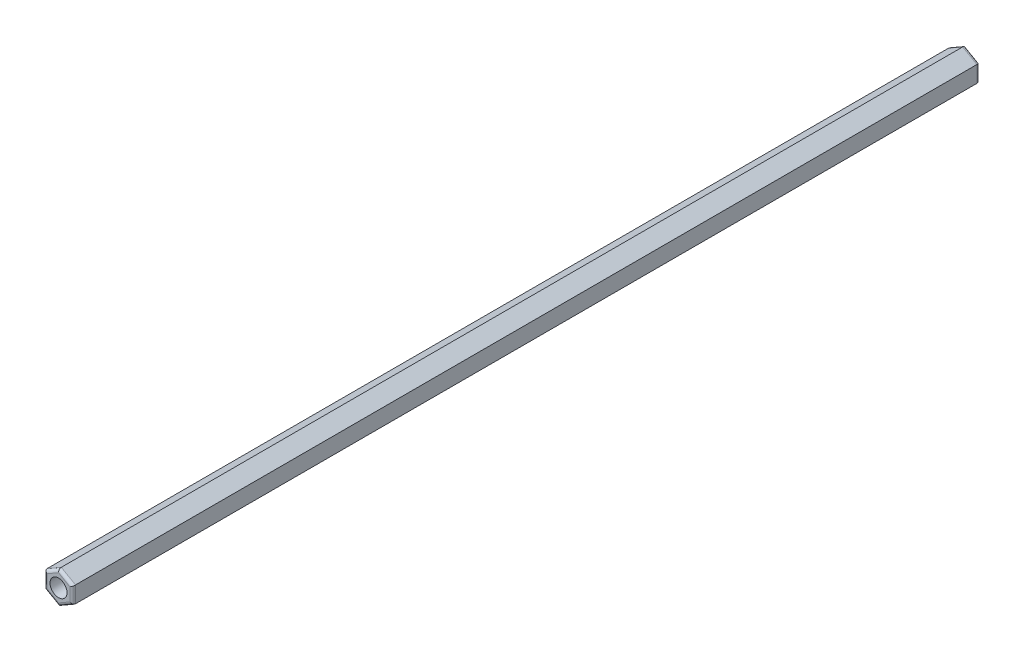
ISO-10303-21;
HEADER;
FILE_DESCRIPTION(('STEP AP214'),'2;1');
FILE_NAME('part.step','',(''),(''),'','','');
FILE_SCHEMA(('AUTOMOTIVE_DESIGN { 1 0 10303 214 1 1 1 1 }'));
ENDSEC;
DATA;
#1=APPLICATION_CONTEXT('core data for automotive mechanical design processes');
#2=APPLICATION_PROTOCOL_DEFINITION('international standard','automotive_design',2000,#1);
#3=PRODUCT_CONTEXT('',#1,'mechanical');
#4=PRODUCT('Part','Part','',(#3));
#5=PRODUCT_RELATED_PRODUCT_CATEGORY('part','',(#4));
#6=PRODUCT_DEFINITION_FORMATION('','',#4);
#7=PRODUCT_DEFINITION_CONTEXT('part definition',#1,'design');
#8=PRODUCT_DEFINITION('design','',#6,#7);
#9=PRODUCT_DEFINITION_SHAPE('','',#8);
#10=(LENGTH_UNIT() NAMED_UNIT(*) SI_UNIT(.MILLI.,.METRE.));
#11=(NAMED_UNIT(*) PLANE_ANGLE_UNIT() SI_UNIT($,.RADIAN.));
#12=(NAMED_UNIT(*) SI_UNIT($,.STERADIAN.) SOLID_ANGLE_UNIT());
#13=UNCERTAINTY_MEASURE_WITH_UNIT(LENGTH_MEASURE(1.E-05),#10,'distance_accuracy_value','');
#14=(GEOMETRIC_REPRESENTATION_CONTEXT(3) GLOBAL_UNCERTAINTY_ASSIGNED_CONTEXT((#13)) GLOBAL_UNIT_ASSIGNED_CONTEXT((#10,
#11,#12)) REPRESENTATION_CONTEXT('',''));
#15=CARTESIAN_POINT('',(0.,0.,0.));
#16=DIRECTION('',(0.,0.,1.));
#17=DIRECTION('',(1.,0.,0.));
#18=AXIS2_PLACEMENT_3D('',#15,#16,#17);
#19=CARTESIAN_POINT('',(-67.50212267549,1.44337567297406,160.));
#20=DIRECTION('',(1.,0.,0.));
#21=DIRECTION('',(0.,0.,-1.));
#22=AXIS2_PLACEMENT_3D('',#19,#20,#21);
#23=PLANE('',#22);
#24=DIRECTION('',(0.,0.,-1.));
#25=VECTOR('',#24,1.);
#26=CARTESIAN_POINT('',(-67.50212267549,-1.44337567297407,160.));
#27=LINE('',#26,#25);
#28=CARTESIAN_POINT('',(-67.50212267549,-1.44337567297407,159.5));
#29=VERTEX_POINT('',#28);
#30=CARTESIAN_POINT('',(-67.50212267549,-1.44337567297407,0.5));
#31=VERTEX_POINT('',#30);
#32=EDGE_CURVE('E152',#29,#31,#27,.T.);
#33=ORIENTED_EDGE('',*,*,#32,.T.);
#34=DIRECTION('',(0.,-1.,0.));
#35=VECTOR('',#34,1.);
#36=CARTESIAN_POINT('',(-67.50212267549,1.44337567297406,0.5));
#37=LINE('',#36,#35);
#38=CARTESIAN_POINT('',(-67.50212267549,1.44337567297406,0.5));
#39=VERTEX_POINT('',#38);
#40=EDGE_CURVE('E149',#31,#39,#37,.F.);
#41=ORIENTED_EDGE('',*,*,#40,.T.);
#42=DIRECTION('',(0.,0.,-1.));
#43=VECTOR('',#42,1.);
#44=CARTESIAN_POINT('',(-67.50212267549,1.44337567297406,160.));
#45=LINE('',#44,#43);
#46=CARTESIAN_POINT('',(-67.50212267549,1.44337567297406,159.5));
#47=VERTEX_POINT('',#46);
#48=EDGE_CURVE('E146',#47,#39,#45,.T.);
#49=ORIENTED_EDGE('',*,*,#48,.F.);
#50=DIRECTION('',(0.,-1.,0.));
#51=VECTOR('',#50,1.);
#52=CARTESIAN_POINT('',(-67.50212267549,-1.44337567297407,159.5));
#53=LINE('',#52,#51);
#54=EDGE_CURVE('E206',#47,#29,#53,.T.);
#55=ORIENTED_EDGE('',*,*,#54,.T.);
#56=EDGE_LOOP('',(#33,#41,#49,#55));
#57=FACE_BOUND('',#56,.T.);
#58=ADVANCED_FACE('F32',(#57),#23,.T.);
#59=CARTESIAN_POINT('',(-70.00212267549,2.88675134594811,160.));
#60=DIRECTION('',(0.5,0.866025403784439,0.));
#61=DIRECTION('',(-0.866025403784439,0.5,0.));
#62=AXIS2_PLACEMENT_3D('',#59,#60,#61);
#63=PLANE('',#62);
#64=ORIENTED_EDGE('',*,*,#48,.T.);
#65=DIRECTION('',(0.866025403784439,-0.5,0.));
#66=VECTOR('',#65,1.);
#67=CARTESIAN_POINT('',(-70.00212267549,2.88675134594811,0.5));
#68=LINE('',#67,#66);
#69=CARTESIAN_POINT('',(-70.00212267549,2.88675134594811,0.5));
#70=VERTEX_POINT('',#69);
#71=EDGE_CURVE('E191',#39,#70,#68,.F.);
#72=ORIENTED_EDGE('',*,*,#71,.T.);
#73=DIRECTION('',(0.,0.,-1.));
#74=VECTOR('',#73,1.);
#75=CARTESIAN_POINT('',(-70.00212267549,2.88675134594811,160.));
#76=LINE('',#75,#74);
#77=CARTESIAN_POINT('',(-70.00212267549,2.88675134594811,159.5));
#78=VERTEX_POINT('',#77);
#79=EDGE_CURVE('E255',#78,#70,#76,.T.);
#80=ORIENTED_EDGE('',*,*,#79,.F.);
#81=DIRECTION('',(0.866025403784439,-0.5,0.));
#82=VECTOR('',#81,1.);
#83=CARTESIAN_POINT('',(-67.50212267549,1.44337567297406,159.5));
#84=LINE('',#83,#82);
#85=EDGE_CURVE('E197',#78,#47,#84,.T.);
#86=ORIENTED_EDGE('',*,*,#85,.T.);
#87=EDGE_LOOP('',(#64,#72,#80,#86));
#88=FACE_BOUND('',#87,.T.);
#89=ADVANCED_FACE('F284',(#88),#63,.T.);
#90=CARTESIAN_POINT('',(-72.50212267549,1.44337567297405,160.));
#91=DIRECTION('',(-0.5,0.866025403784439,0.));
#92=DIRECTION('',(-0.866025403784439,-0.5,0.));
#93=AXIS2_PLACEMENT_3D('',#90,#91,#92);
#94=PLANE('',#93);
#95=ORIENTED_EDGE('',*,*,#79,.T.);
#96=DIRECTION('',(0.866025403784439,0.5,0.));
#97=VECTOR('',#96,1.);
#98=CARTESIAN_POINT('',(-72.50212267549,1.44337567297405,0.5));
#99=LINE('',#98,#97);
#100=CARTESIAN_POINT('',(-72.50212267549,1.44337567297405,0.5));
#101=VERTEX_POINT('',#100);
#102=EDGE_CURVE('E231',#70,#101,#99,.F.);
#103=ORIENTED_EDGE('',*,*,#102,.T.);
#104=DIRECTION('',(0.,0.,-1.));
#105=VECTOR('',#104,1.);
#106=CARTESIAN_POINT('',(-72.50212267549,1.44337567297405,160.));
#107=LINE('',#106,#105);
#108=CARTESIAN_POINT('',(-72.50212267549,1.44337567297405,159.5));
#109=VERTEX_POINT('',#108);
#110=EDGE_CURVE('E253',#109,#101,#107,.T.);
#111=ORIENTED_EDGE('',*,*,#110,.F.);
#112=DIRECTION('',(0.866025403784439,0.5,0.));
#113=VECTOR('',#112,1.);
#114=CARTESIAN_POINT('',(-70.00212267549,2.88675134594811,159.5));
#115=LINE('',#114,#113);
#116=EDGE_CURVE('E234',#109,#78,#115,.T.);
#117=ORIENTED_EDGE('',*,*,#116,.T.);
#118=EDGE_LOOP('',(#95,#103,#111,#117));
#119=FACE_BOUND('',#118,.T.);
#120=ADVANCED_FACE('F290',(#119),#94,.T.);
#121=CARTESIAN_POINT('',(-72.50212267549,-1.44337567297407,160.));
#122=DIRECTION('',(-1.,0.,0.));
#123=DIRECTION('',(0.,0.,1.));
#124=AXIS2_PLACEMENT_3D('',#121,#122,#123);
#125=PLANE('',#124);
#126=ORIENTED_EDGE('',*,*,#110,.T.);
#127=DIRECTION('',(0.,1.,0.));
#128=VECTOR('',#127,1.);
#129=CARTESIAN_POINT('',(-72.50212267549,-1.44337567297407,0.5));
#130=LINE('',#129,#128);
#131=CARTESIAN_POINT('',(-72.50212267549,-1.44337567297407,0.5));
#132=VERTEX_POINT('',#131);
#133=EDGE_CURVE('E201',#101,#132,#130,.F.);
#134=ORIENTED_EDGE('',*,*,#133,.T.);
#135=DIRECTION('',(0.,0.,-1.));
#136=VECTOR('',#135,1.);
#137=CARTESIAN_POINT('',(-72.50212267549,-1.44337567297407,160.));
#138=LINE('',#137,#136);
#139=CARTESIAN_POINT('',(-72.50212267549,-1.44337567297407,159.5));
#140=VERTEX_POINT('',#139);
#141=EDGE_CURVE('E250',#140,#132,#138,.T.);
#142=ORIENTED_EDGE('',*,*,#141,.F.);
#143=DIRECTION('',(0.,1.,0.));
#144=VECTOR('',#143,1.);
#145=CARTESIAN_POINT('',(-72.50212267549,1.44337567297405,159.5));
#146=LINE('',#145,#144);
#147=EDGE_CURVE('E226',#140,#109,#146,.T.);
#148=ORIENTED_EDGE('',*,*,#147,.T.);
#149=EDGE_LOOP('',(#126,#134,#142,#148));
#150=FACE_BOUND('',#149,.T.);
#151=ADVANCED_FACE('F341',(#150),#125,.T.);
#152=CARTESIAN_POINT('',(-70.00212267549,-2.88675134594813,160.));
#153=DIRECTION('',(-0.499999999999999,-0.866025403784439,0.));
#154=DIRECTION('',(0.866025403784439,-0.499999999999999,0.));
#155=AXIS2_PLACEMENT_3D('',#152,#153,#154);
#156=PLANE('',#155);
#157=ORIENTED_EDGE('',*,*,#141,.T.);
#158=DIRECTION('',(-0.866025403784439,0.499999999999999,0.));
#159=VECTOR('',#158,1.);
#160=CARTESIAN_POINT('',(-70.00212267549,-2.88675134594813,0.5));
#161=LINE('',#160,#159);
#162=CARTESIAN_POINT('',(-70.00212267549,-2.88675134594813,0.5));
#163=VERTEX_POINT('',#162);
#164=EDGE_CURVE('E199',#132,#163,#161,.F.);
#165=ORIENTED_EDGE('',*,*,#164,.T.);
#166=DIRECTION('',(0.,0.,-1.));
#167=VECTOR('',#166,1.);
#168=CARTESIAN_POINT('',(-70.00212267549,-2.88675134594813,160.));
#169=LINE('',#168,#167);
#170=CARTESIAN_POINT('',(-70.00212267549,-2.88675134594813,159.5));
#171=VERTEX_POINT('',#170);
#172=EDGE_CURVE('E247',#171,#163,#169,.T.);
#173=ORIENTED_EDGE('',*,*,#172,.F.);
#174=DIRECTION('',(-0.866025403784439,0.499999999999999,0.));
#175=VECTOR('',#174,1.);
#176=CARTESIAN_POINT('',(-72.50212267549,-1.44337567297407,159.5));
#177=LINE('',#176,#175);
#178=EDGE_CURVE('E196',#171,#140,#177,.T.);
#179=ORIENTED_EDGE('',*,*,#178,.T.);
#180=EDGE_LOOP('',(#157,#165,#173,#179));
#181=FACE_BOUND('',#180,.T.);
#182=ADVANCED_FACE('F280',(#181),#156,.T.);
#183=CARTESIAN_POINT('',(-67.50212267549,-1.44337567297407,160.));
#184=DIRECTION('',(0.500000000000001,-0.866025403784438,0.));
#185=DIRECTION('',(0.866025403784438,0.500000000000001,0.));
#186=AXIS2_PLACEMENT_3D('',#183,#184,#185);
#187=PLANE('',#186);
#188=ORIENTED_EDGE('',*,*,#172,.T.);
#189=DIRECTION('',(-0.866025403784438,-0.500000000000001,0.));
#190=VECTOR('',#189,1.);
#191=CARTESIAN_POINT('',(-67.50212267549,-1.44337567297407,0.5));
#192=LINE('',#191,#190);
#193=EDGE_CURVE('E211',#163,#31,#192,.F.);
#194=ORIENTED_EDGE('',*,*,#193,.T.);
#195=ORIENTED_EDGE('',*,*,#32,.F.);
#196=DIRECTION('',(-0.866025403784438,-0.500000000000001,0.));
#197=VECTOR('',#196,1.);
#198=CARTESIAN_POINT('',(-70.00212267549,-2.88675134594813,159.5));
#199=LINE('',#198,#197);
#200=EDGE_CURVE('E209',#29,#171,#199,.T.);
#201=ORIENTED_EDGE('',*,*,#200,.T.);
#202=EDGE_LOOP('',(#188,#194,#195,#201));
#203=FACE_BOUND('',#202,.T.);
#204=ADVANCED_FACE('F273',(#203),#187,.T.);
#205=CARTESIAN_POINT('',(0.,0.,160.));
#206=DIRECTION('',(0.,0.,-1.));
#207=DIRECTION('',(-1.,0.,0.));
#208=AXIS2_PLACEMENT_3D('',#205,#206,#207);
#209=PLANE('',#208);
#210=CARTESIAN_POINT('',(-70.00212267549,0.,160.));
#211=DIRECTION('',(0.,0.,1.));
#212=DIRECTION('',(1.,0.,0.));
#213=AXIS2_PLACEMENT_3D('',#210,#211,#212);
#214=CIRCLE('',#213,1.5);
#215=CARTESIAN_POINT('',(-68.50212267549,0.,160.));
#216=VERTEX_POINT('',#215);
#217=EDGE_CURVE('E258',#216,#216,#214,.T.);
#218=ORIENTED_EDGE('',*,*,#217,.F.);
#219=EDGE_LOOP('',(#218));
#220=FACE_BOUND('',#219,.T.);
#221=DIRECTION('',(0.866025403784439,-0.5,0.));
#222=VECTOR('',#221,1.);
#223=CARTESIAN_POINT('',(-70.25212267549,2.45373864405589,160.));
#224=LINE('',#223,#222);
#225=CARTESIAN_POINT('',(-68.00212267549,1.15470053837924,160.));
#226=VERTEX_POINT('',#225);
#227=CARTESIAN_POINT('',(-70.00212267549,2.30940107675849,160.));
#228=VERTEX_POINT('',#227);
#229=EDGE_CURVE('E56',#226,#228,#224,.F.);
#230=ORIENTED_EDGE('',*,*,#229,.T.);
#231=DIRECTION('',(0.866025403784439,0.5,0.));
#232=VECTOR('',#231,1.);
#233=CARTESIAN_POINT('',(-72.25212267549,1.01036297108183,160.));
#234=LINE('',#233,#232);
#235=CARTESIAN_POINT('',(-72.00212267549,1.15470053837923,160.));
#236=VERTEX_POINT('',#235);
#237=EDGE_CURVE('E11',#228,#236,#234,.F.);
#238=ORIENTED_EDGE('',*,*,#237,.T.);
#239=DIRECTION('',(0.,1.,0.));
#240=VECTOR('',#239,1.);
#241=CARTESIAN_POINT('',(-72.00212267549,-1.44337567297407,160.));
#242=LINE('',#241,#240);
#243=CARTESIAN_POINT('',(-72.00212267549,-1.15470053837925,160.));
#244=VERTEX_POINT('',#243);
#245=EDGE_CURVE('E41',#236,#244,#242,.F.);
#246=ORIENTED_EDGE('',*,*,#245,.T.);
#247=DIRECTION('',(-0.866025403784439,0.499999999999999,0.));
#248=VECTOR('',#247,1.);
#249=CARTESIAN_POINT('',(-69.75212267549,-2.45373864405591,160.));
#250=LINE('',#249,#248);
#251=CARTESIAN_POINT('',(-70.00212267549,-2.3094010767585,160.));
#252=VERTEX_POINT('',#251);
#253=EDGE_CURVE('E217',#244,#252,#250,.F.);
#254=ORIENTED_EDGE('',*,*,#253,.T.);
#255=DIRECTION('',(-0.866025403784438,-0.500000000000001,0.));
#256=VECTOR('',#255,1.);
#257=CARTESIAN_POINT('',(-67.75212267549,-1.01036297108185,160.));
#258=LINE('',#257,#256);
#259=CARTESIAN_POINT('',(-68.00212267549,-1.15470053837926,160.));
#260=VERTEX_POINT('',#259);
#261=EDGE_CURVE('E213',#252,#260,#258,.F.);
#262=ORIENTED_EDGE('',*,*,#261,.T.);
#263=DIRECTION('',(0.,-1.,0.));
#264=VECTOR('',#263,1.);
#265=CARTESIAN_POINT('',(-68.00212267549,1.44337567297406,160.));
#266=LINE('',#265,#264);
#267=EDGE_CURVE('E215',#260,#226,#266,.F.);
#268=ORIENTED_EDGE('',*,*,#267,.T.);
#269=EDGE_LOOP('',(#230,#238,#246,#254,#262,#268));
#270=FACE_BOUND('',#269,.T.);
#271=ADVANCED_FACE('F219',(#220,#270),#209,.F.);
#272=CARTESIAN_POINT('',(0.,0.,0.));
#273=DIRECTION('',(0.,0.,-1.));
#274=DIRECTION('',(-1.,0.,0.));
#275=AXIS2_PLACEMENT_3D('',#272,#273,#274);
#276=PLANE('',#275);
#277=CARTESIAN_POINT('',(-70.00212267549,0.,0.));
#278=DIRECTION('',(0.,0.,1.));
#279=DIRECTION('',(1.,0.,0.));
#280=AXIS2_PLACEMENT_3D('',#277,#278,#279);
#281=CIRCLE('',#280,1.5);
#282=CARTESIAN_POINT('',(-68.50212267549,0.,0.));
#283=VERTEX_POINT('',#282);
#284=EDGE_CURVE('E161',#283,#283,#281,.T.);
#285=ORIENTED_EDGE('',*,*,#284,.T.);
#286=EDGE_LOOP('',(#285));
#287=FACE_BOUND('',#286,.T.);
#288=DIRECTION('',(0.,1.,0.));
#289=VECTOR('',#288,1.);
#290=CARTESIAN_POINT('',(-72.00212267549,0.,0.));
#291=LINE('',#290,#289);
#292=CARTESIAN_POINT('',(-72.00212267549,-1.15470053837926,0.));
#293=VERTEX_POINT('',#292);
#294=CARTESIAN_POINT('',(-72.00212267549,1.15470053837923,0.));
#295=VERTEX_POINT('',#294);
#296=EDGE_CURVE('E241',#293,#295,#291,.T.);
#297=ORIENTED_EDGE('',*,*,#296,.T.);
#298=DIRECTION('',(0.866025403784439,0.5,0.));
#299=VECTOR('',#298,1.);
#300=CARTESIAN_POINT('',(-18.5005306688725,32.0438590854734,0.));
#301=LINE('',#300,#299);
#302=CARTESIAN_POINT('',(-70.00212267549,2.30940107675848,0.));
#303=VERTEX_POINT('',#302);
#304=EDGE_CURVE('E239',#295,#303,#301,.T.);
#305=ORIENTED_EDGE('',*,*,#304,.T.);
#306=DIRECTION('',(0.866025403784439,-0.5,0.));
#307=VECTOR('',#306,1.);
#308=CARTESIAN_POINT('',(-16.5005306688725,-28.5797574703356,0.));
#309=LINE('',#308,#307);
#310=CARTESIAN_POINT('',(-68.00212267549,1.15470053837924,0.));
#311=VERTEX_POINT('',#310);
#312=EDGE_CURVE('E130',#303,#311,#309,.T.);
#313=ORIENTED_EDGE('',*,*,#312,.T.);
#314=DIRECTION('',(0.,-1.,0.));
#315=VECTOR('',#314,1.);
#316=CARTESIAN_POINT('',(-68.00212267549,0.,0.));
#317=LINE('',#316,#315);
#318=CARTESIAN_POINT('',(-68.00212267549,-1.15470053837925,0.));
#319=VERTEX_POINT('',#318);
#320=EDGE_CURVE('E123',#311,#319,#317,.T.);
#321=ORIENTED_EDGE('',*,*,#320,.T.);
#322=DIRECTION('',(-0.866025403784438,-0.500000000000001,0.));
#323=VECTOR('',#322,1.);
#324=CARTESIAN_POINT('',(-16.5005306688726,28.5797574703357,0.));
#325=LINE('',#324,#323);
#326=CARTESIAN_POINT('',(-70.00212267549,-2.30940107675851,0.));
#327=VERTEX_POINT('',#326);
#328=EDGE_CURVE('E126',#319,#327,#325,.T.);
#329=ORIENTED_EDGE('',*,*,#328,.T.);
#330=DIRECTION('',(-0.866025403784439,0.499999999999999,0.));
#331=VECTOR('',#330,1.);
#332=CARTESIAN_POINT('',(-18.5005306688724,-32.0438590854734,0.));
#333=LINE('',#332,#331);
#334=EDGE_CURVE('E135',#327,#293,#333,.T.);
#335=ORIENTED_EDGE('',*,*,#334,.T.);
#336=EDGE_LOOP('',(#297,#305,#313,#321,#329,#335));
#337=FACE_BOUND('',#336,.T.);
#338=ADVANCED_FACE('F125',(#287,#337),#276,.T.);
#339=CARTESIAN_POINT('',(-16.5005306688726,28.5797574703357,0.5));
#340=DIRECTION('',(-0.866025403784438,-0.500000000000001,0.));
#341=DIRECTION('',(0.500000000000001,-0.866025403784438,0.));
#342=AXIS2_PLACEMENT_3D('',#339,#340,#341);
#343=CYLINDRICAL_SURFACE('',#342,0.5);
#344=CARTESIAN_POINT('',(-68.00212267549,-1.15470053837925,0.5));
#345=DIRECTION('',(-0.5,-0.866025403784439,0.));
#346=DIRECTION('',(-0.866025403784439,0.5,0.));
#347=AXIS2_PLACEMENT_3D('',#344,#345,#346);
#348=ELLIPSE('',#347,0.577350269189626,0.5);
#349=EDGE_CURVE('E141',#31,#319,#348,.F.);
#350=ORIENTED_EDGE('',*,*,#349,.F.);
#351=ORIENTED_EDGE('',*,*,#193,.F.);
#352=CARTESIAN_POINT('',(-70.00212267549,-2.3094010767585,0.5));
#353=DIRECTION('',(-1.,0.,0.));
#354=DIRECTION('',(0.,-1.,0.));
#355=AXIS2_PLACEMENT_3D('',#352,#353,#354);
#356=ELLIPSE('',#355,0.577350269189626,0.5);
#357=EDGE_CURVE('E144',#327,#163,#356,.T.);
#358=ORIENTED_EDGE('',*,*,#357,.F.);
#359=ORIENTED_EDGE('',*,*,#328,.F.);
#360=EDGE_LOOP('',(#350,#351,#358,#359));
#361=FACE_BOUND('',#360,.T.);
#362=ADVANCED_FACE('F139',(#361),#343,.T.);
#363=CARTESIAN_POINT('',(-18.5005306688724,-32.0438590854734,0.5));
#364=DIRECTION('',(-0.866025403784439,0.499999999999999,0.));
#365=DIRECTION('',(-0.499999999999999,-0.866025403784439,0.));
#366=AXIS2_PLACEMENT_3D('',#363,#364,#365);
#367=CYLINDRICAL_SURFACE('',#366,0.5);
#368=ORIENTED_EDGE('',*,*,#357,.T.);
#369=ORIENTED_EDGE('',*,*,#164,.F.);
#370=CARTESIAN_POINT('',(-72.00212267549,-1.15470053837926,0.5));
#371=DIRECTION('',(-0.500000000000001,0.866025403784438,0.));
#372=DIRECTION('',(-0.866025403784438,-0.500000000000001,0.));
#373=AXIS2_PLACEMENT_3D('',#370,#371,#372);
#374=ELLIPSE('',#373,0.577350269189626,0.5);
#375=EDGE_CURVE('E150',#293,#132,#374,.T.);
#376=ORIENTED_EDGE('',*,*,#375,.F.);
#377=ORIENTED_EDGE('',*,*,#334,.F.);
#378=EDGE_LOOP('',(#368,#369,#376,#377));
#379=FACE_BOUND('',#378,.T.);
#380=ADVANCED_FACE('F305',(#379),#367,.T.);
#381=CARTESIAN_POINT('',(-68.00212267549,0.,0.5));
#382=DIRECTION('',(0.,-1.,0.));
#383=DIRECTION('',(0.,0.,-1.));
#384=AXIS2_PLACEMENT_3D('',#381,#382,#383);
#385=CYLINDRICAL_SURFACE('',#384,0.5);
#386=ORIENTED_EDGE('',*,*,#349,.T.);
#387=ORIENTED_EDGE('',*,*,#320,.F.);
#388=CARTESIAN_POINT('',(-68.00212267549,1.15470053837924,0.5));
#389=DIRECTION('',(0.5,-0.866025403784439,0.));
#390=DIRECTION('',(-0.866025403784439,-0.5,0.));
#391=AXIS2_PLACEMENT_3D('',#388,#389,#390);
#392=ELLIPSE('',#391,0.577350269189626,0.5);
#393=EDGE_CURVE('E155',#39,#311,#392,.F.);
#394=ORIENTED_EDGE('',*,*,#393,.F.);
#395=ORIENTED_EDGE('',*,*,#40,.F.);
#396=EDGE_LOOP('',(#386,#387,#394,#395));
#397=FACE_BOUND('',#396,.T.);
#398=ADVANCED_FACE('F148',(#397),#385,.T.);
#399=CARTESIAN_POINT('',(-72.00212267549,0.,0.5));
#400=DIRECTION('',(0.,1.,0.));
#401=DIRECTION('',(0.,0.,1.));
#402=AXIS2_PLACEMENT_3D('',#399,#400,#401);
#403=CYLINDRICAL_SURFACE('',#402,0.5);
#404=ORIENTED_EDGE('',*,*,#375,.T.);
#405=ORIENTED_EDGE('',*,*,#133,.F.);
#406=CARTESIAN_POINT('',(-72.00212267549,1.15470053837923,0.5));
#407=DIRECTION('',(0.5,0.866025403784439,0.));
#408=DIRECTION('',(-0.866025403784439,0.5,0.));
#409=AXIS2_PLACEMENT_3D('',#406,#407,#408);
#410=ELLIPSE('',#409,0.577350269189626,0.5);
#411=EDGE_CURVE('E180',#295,#101,#410,.T.);
#412=ORIENTED_EDGE('',*,*,#411,.F.);
#413=ORIENTED_EDGE('',*,*,#296,.F.);
#414=EDGE_LOOP('',(#404,#405,#412,#413));
#415=FACE_BOUND('',#414,.T.);
#416=ADVANCED_FACE('F299',(#415),#403,.T.);
#417=CARTESIAN_POINT('',(-16.5005306688725,-28.5797574703356,0.5));
#418=DIRECTION('',(0.866025403784439,-0.5,0.));
#419=DIRECTION('',(0.5,0.866025403784439,0.));
#420=AXIS2_PLACEMENT_3D('',#417,#418,#419);
#421=CYLINDRICAL_SURFACE('',#420,0.5);
#422=ORIENTED_EDGE('',*,*,#393,.T.);
#423=ORIENTED_EDGE('',*,*,#312,.F.);
#424=CARTESIAN_POINT('',(-70.00212267549,2.30940107675849,0.5));
#425=DIRECTION('',(1.,0.,0.));
#426=DIRECTION('',(0.,-1.,0.));
#427=AXIS2_PLACEMENT_3D('',#424,#425,#426);
#428=ELLIPSE('',#427,0.577350269189626,0.5);
#429=EDGE_CURVE('E175',#70,#303,#428,.F.);
#430=ORIENTED_EDGE('',*,*,#429,.F.);
#431=ORIENTED_EDGE('',*,*,#71,.F.);
#432=EDGE_LOOP('',(#422,#423,#430,#431));
#433=FACE_BOUND('',#432,.T.);
#434=ADVANCED_FACE('F190',(#433),#421,.T.);
#435=CARTESIAN_POINT('',(-18.5005306688725,32.0438590854734,0.5));
#436=DIRECTION('',(0.866025403784439,0.5,0.));
#437=DIRECTION('',(-0.5,0.866025403784439,0.));
#438=AXIS2_PLACEMENT_3D('',#435,#436,#437);
#439=CYLINDRICAL_SURFACE('',#438,0.5);
#440=ORIENTED_EDGE('',*,*,#411,.T.);
#441=ORIENTED_EDGE('',*,*,#102,.F.);
#442=ORIENTED_EDGE('',*,*,#429,.T.);
#443=ORIENTED_EDGE('',*,*,#304,.F.);
#444=EDGE_LOOP('',(#440,#441,#442,#443));
#445=FACE_BOUND('',#444,.T.);
#446=ADVANCED_FACE('F294',(#445),#439,.T.);
#447=CARTESIAN_POINT('',(-67.75212267549,-1.01036297108185,159.5));
#448=DIRECTION('',(0.866025403784438,0.500000000000001,0.));
#449=DIRECTION('',(-0.500000000000001,0.866025403784438,0.));
#450=AXIS2_PLACEMENT_3D('',#447,#448,#449);
#451=CYLINDRICAL_SURFACE('',#450,0.5);
#452=CARTESIAN_POINT('',(-68.00212267549,-1.15470053837926,159.5));
#453=DIRECTION('',(0.5,0.866025403784439,0.));
#454=DIRECTION('',(0.866025403784439,-0.5,0.));
#455=AXIS2_PLACEMENT_3D('',#452,#453,#454);
#456=ELLIPSE('',#455,0.577350269189626,0.5);
#457=EDGE_CURVE('E168',#260,#29,#456,.T.);
#458=ORIENTED_EDGE('',*,*,#457,.F.);
#459=ORIENTED_EDGE('',*,*,#261,.F.);
#460=CARTESIAN_POINT('',(-70.00212267549,-2.3094010767585,159.5));
#461=DIRECTION('',(1.,0.,0.));
#462=DIRECTION('',(0.,1.,0.));
#463=AXIS2_PLACEMENT_3D('',#460,#461,#462);
#464=ELLIPSE('',#463,0.577350269189626,0.5);
#465=EDGE_CURVE('E36',#171,#252,#464,.F.);
#466=ORIENTED_EDGE('',*,*,#465,.F.);
#467=ORIENTED_EDGE('',*,*,#200,.F.);
#468=EDGE_LOOP('',(#458,#459,#466,#467));
#469=FACE_BOUND('',#468,.T.);
#470=ADVANCED_FACE('F34',(#469),#451,.T.);
#471=CARTESIAN_POINT('',(-69.75212267549,-2.45373864405591,159.5));
#472=DIRECTION('',(0.866025403784439,-0.499999999999999,0.));
#473=DIRECTION('',(0.499999999999999,0.866025403784439,0.));
#474=AXIS2_PLACEMENT_3D('',#471,#472,#473);
#475=CYLINDRICAL_SURFACE('',#474,0.5);
#476=ORIENTED_EDGE('',*,*,#465,.T.);
#477=ORIENTED_EDGE('',*,*,#253,.F.);
#478=CARTESIAN_POINT('',(-72.00212267549,-1.15470053837925,159.5));
#479=DIRECTION('',(0.500000000000001,-0.866025403784438,0.));
#480=DIRECTION('',(0.866025403784438,0.500000000000001,0.));
#481=AXIS2_PLACEMENT_3D('',#478,#479,#480);
#482=ELLIPSE('',#481,0.577350269189626,0.5);
#483=EDGE_CURVE('E166',#140,#244,#482,.F.);
#484=ORIENTED_EDGE('',*,*,#483,.F.);
#485=ORIENTED_EDGE('',*,*,#178,.F.);
#486=EDGE_LOOP('',(#476,#477,#484,#485));
#487=FACE_BOUND('',#486,.T.);
#488=ADVANCED_FACE('F223',(#487),#475,.T.);
#489=CARTESIAN_POINT('',(-68.00212267549,1.44337567297406,159.5));
#490=DIRECTION('',(0.,1.,0.));
#491=DIRECTION('',(0.,0.,1.));
#492=AXIS2_PLACEMENT_3D('',#489,#490,#491);
#493=CYLINDRICAL_SURFACE('',#492,0.5);
#494=ORIENTED_EDGE('',*,*,#457,.T.);
#495=ORIENTED_EDGE('',*,*,#54,.F.);
#496=CARTESIAN_POINT('',(-68.00212267549,1.15470053837924,159.5));
#497=DIRECTION('',(-0.5,0.866025403784439,0.));
#498=DIRECTION('',(0.866025403784439,0.5,0.));
#499=AXIS2_PLACEMENT_3D('',#496,#497,#498);
#500=ELLIPSE('',#499,0.577350269189626,0.5);
#501=EDGE_CURVE('E163',#226,#47,#500,.T.);
#502=ORIENTED_EDGE('',*,*,#501,.F.);
#503=ORIENTED_EDGE('',*,*,#267,.F.);
#504=EDGE_LOOP('',(#494,#495,#502,#503));
#505=FACE_BOUND('',#504,.T.);
#506=ADVANCED_FACE('F319',(#505),#493,.T.);
#507=CARTESIAN_POINT('',(-72.00212267549,-1.44337567297407,159.5));
#508=DIRECTION('',(0.,-1.,0.));
#509=DIRECTION('',(0.,0.,-1.));
#510=AXIS2_PLACEMENT_3D('',#507,#508,#509);
#511=CYLINDRICAL_SURFACE('',#510,0.5);
#512=ORIENTED_EDGE('',*,*,#483,.T.);
#513=ORIENTED_EDGE('',*,*,#245,.F.);
#514=CARTESIAN_POINT('',(-72.00212267549,1.15470053837923,159.5));
#515=DIRECTION('',(-0.5,-0.866025403784439,0.));
#516=DIRECTION('',(0.866025403784439,-0.5,0.));
#517=AXIS2_PLACEMENT_3D('',#514,#515,#516);
#518=ELLIPSE('',#517,0.577350269189626,0.5);
#519=EDGE_CURVE('E49',#109,#236,#518,.F.);
#520=ORIENTED_EDGE('',*,*,#519,.F.);
#521=ORIENTED_EDGE('',*,*,#147,.F.);
#522=EDGE_LOOP('',(#512,#513,#520,#521));
#523=FACE_BOUND('',#522,.T.);
#524=ADVANCED_FACE('F225',(#523),#511,.T.);
#525=CARTESIAN_POINT('',(-70.25212267549,2.45373864405589,159.5));
#526=DIRECTION('',(-0.866025403784439,0.5,0.));
#527=DIRECTION('',(-0.5,-0.866025403784439,0.));
#528=AXIS2_PLACEMENT_3D('',#525,#526,#527);
#529=CYLINDRICAL_SURFACE('',#528,0.5);
#530=ORIENTED_EDGE('',*,*,#501,.T.);
#531=ORIENTED_EDGE('',*,*,#85,.F.);
#532=CARTESIAN_POINT('',(-70.00212267549,2.30940107675849,159.5));
#533=DIRECTION('',(-1.,0.,0.));
#534=DIRECTION('',(0.,1.,0.));
#535=AXIS2_PLACEMENT_3D('',#532,#533,#534);
#536=ELLIPSE('',#535,0.577350269189626,0.5);
#537=EDGE_CURVE('E159',#228,#78,#536,.T.);
#538=ORIENTED_EDGE('',*,*,#537,.F.);
#539=ORIENTED_EDGE('',*,*,#229,.F.);
#540=EDGE_LOOP('',(#530,#531,#538,#539));
#541=FACE_BOUND('',#540,.T.);
#542=ADVANCED_FACE('F313',(#541),#529,.T.);
#543=CARTESIAN_POINT('',(-72.25212267549,1.01036297108183,159.5));
#544=DIRECTION('',(-0.866025403784439,-0.5,0.));
#545=DIRECTION('',(0.5,-0.866025403784439,0.));
#546=AXIS2_PLACEMENT_3D('',#543,#544,#545);
#547=CYLINDRICAL_SURFACE('',#546,0.5);
#548=ORIENTED_EDGE('',*,*,#519,.T.);
#549=ORIENTED_EDGE('',*,*,#237,.F.);
#550=ORIENTED_EDGE('',*,*,#537,.T.);
#551=ORIENTED_EDGE('',*,*,#116,.F.);
#552=EDGE_LOOP('',(#548,#549,#550,#551));
#553=FACE_BOUND('',#552,.T.);
#554=ADVANCED_FACE('F268',(#553),#547,.T.);
#555=CARTESIAN_POINT('',(-70.00212267549,0.,0.));
#556=DIRECTION('',(0.,0.,1.));
#557=DIRECTION('',(1.,0.,0.));
#558=AXIS2_PLACEMENT_3D('',#555,#556,#557);
#559=CYLINDRICAL_SURFACE('',#558,1.5);
#560=ORIENTED_EDGE('',*,*,#284,.F.);
#561=EDGE_LOOP('',(#560));
#562=FACE_BOUND('',#561,.T.);
#563=ORIENTED_EDGE('',*,*,#217,.T.);
#564=EDGE_LOOP('',(#563));
#565=FACE_BOUND('',#564,.T.);
#566=ADVANCED_FACE('F265',(#562,#565),#559,.F.);
#567=CLOSED_SHELL('',(#58,#89,#120,#151,#182,#204,#271,#338,#362,#380,#398,#416,#434,#446,#470,
#488,#506,#524,#542,#554,#566));
#568=MANIFOLD_SOLID_BREP('B2',#567);
#569=ADVANCED_BREP_SHAPE_REPRESENTATION('',(#18,#568),#14);
#570=SHAPE_DEFINITION_REPRESENTATION(#9,#569);
ENDSEC;
END-ISO-10303-21;
